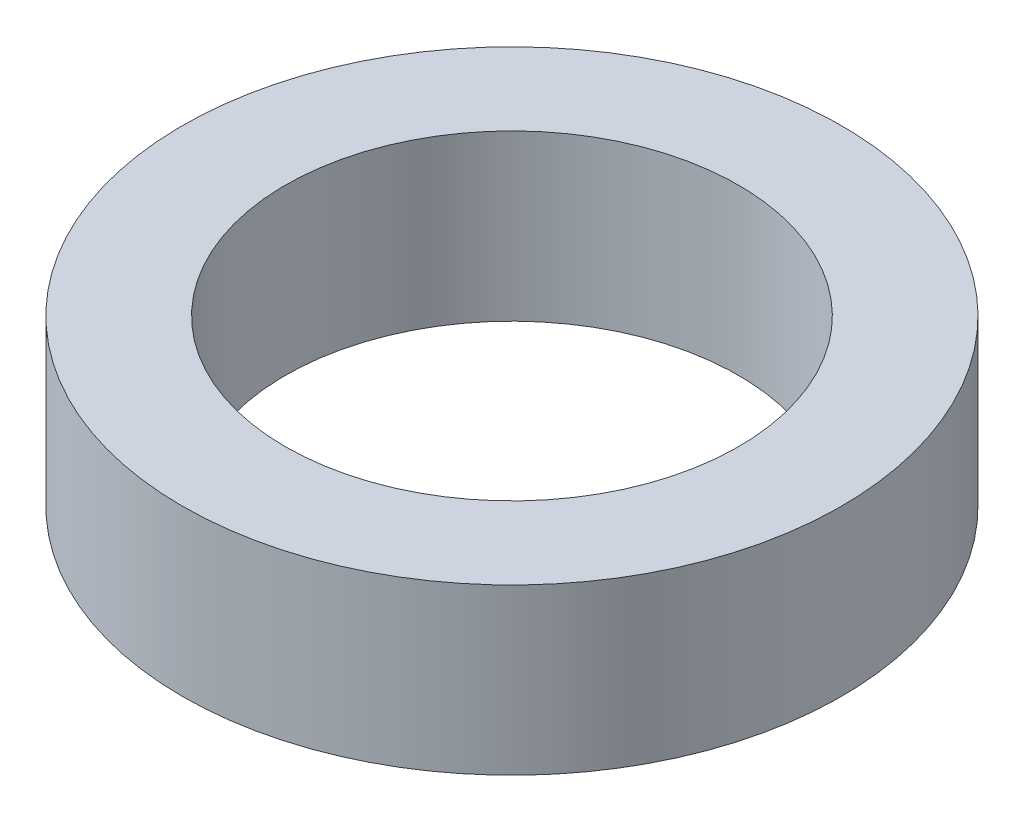
ISO-10303-21;
HEADER;
FILE_DESCRIPTION(('STEP AP214'),'2;1');
FILE_NAME('part.step','',(''),(''),'','','');
FILE_SCHEMA(('AUTOMOTIVE_DESIGN { 1 0 10303 214 1 1 1 1 }'));
ENDSEC;
DATA;
#1=APPLICATION_CONTEXT('core data for automotive mechanical design processes');
#2=APPLICATION_PROTOCOL_DEFINITION('international standard','automotive_design',2000,#1);
#3=PRODUCT_CONTEXT('',#1,'mechanical');
#4=PRODUCT('Part','Part','',(#3));
#5=PRODUCT_RELATED_PRODUCT_CATEGORY('part','',(#4));
#6=PRODUCT_DEFINITION_FORMATION('','',#4);
#7=PRODUCT_DEFINITION_CONTEXT('part definition',#1,'design');
#8=PRODUCT_DEFINITION('design','',#6,#7);
#9=PRODUCT_DEFINITION_SHAPE('','',#8);
#10=(LENGTH_UNIT() NAMED_UNIT(*) SI_UNIT(.MILLI.,.METRE.));
#11=(NAMED_UNIT(*) PLANE_ANGLE_UNIT() SI_UNIT($,.RADIAN.));
#12=(NAMED_UNIT(*) SI_UNIT($,.STERADIAN.) SOLID_ANGLE_UNIT());
#13=UNCERTAINTY_MEASURE_WITH_UNIT(LENGTH_MEASURE(1.E-05),#10,'distance_accuracy_value','');
#14=(GEOMETRIC_REPRESENTATION_CONTEXT(3) GLOBAL_UNCERTAINTY_ASSIGNED_CONTEXT((#13)) GLOBAL_UNIT_ASSIGNED_CONTEXT((#10,
#11,#12)) REPRESENTATION_CONTEXT('',''));
#15=CARTESIAN_POINT('',(0.,0.,0.));
#16=DIRECTION('',(0.,0.,1.));
#17=DIRECTION('',(1.,0.,0.));
#18=AXIS2_PLACEMENT_3D('',#15,#16,#17);
#19=CARTESIAN_POINT('',(0.,1.5875,0.));
#20=DIRECTION('',(0.,1.,0.));
#21=DIRECTION('',(0.,0.,1.));
#22=AXIS2_PLACEMENT_3D('',#19,#20,#21);
#23=PLANE('',#22);
#24=CARTESIAN_POINT('',(0.,1.5875,0.));
#25=DIRECTION('',(0.,1.,0.));
#26=DIRECTION('',(0.,0.,1.));
#27=AXIS2_PLACEMENT_3D('',#24,#25,#26);
#28=CIRCLE('',#27,3.175);
#29=CARTESIAN_POINT('',(0.,1.5875,3.175));
#30=VERTEX_POINT('',#29);
#31=EDGE_CURVE('E10',#30,#30,#28,.T.);
#32=ORIENTED_EDGE('',*,*,#31,.T.);
#33=EDGE_LOOP('',(#32));
#34=FACE_BOUND('',#33,.T.);
#35=CARTESIAN_POINT('',(0.,1.5875,0.));
#36=DIRECTION('',(0.,1.,0.));
#37=DIRECTION('',(0.,0.,1.));
#38=AXIS2_PLACEMENT_3D('',#35,#36,#37);
#39=CIRCLE('',#38,2.1828125);
#40=CARTESIAN_POINT('',(0.,1.5875,2.1828125));
#41=VERTEX_POINT('',#40);
#42=EDGE_CURVE('E52',#41,#41,#39,.T.);
#43=ORIENTED_EDGE('',*,*,#42,.F.);
#44=EDGE_LOOP('',(#43));
#45=FACE_BOUND('',#44,.T.);
#46=ADVANCED_FACE('F39',(#34,#45),#23,.T.);
#47=CARTESIAN_POINT('',(0.,0.,0.));
#48=DIRECTION('',(0.,1.,0.));
#49=DIRECTION('',(0.,0.,1.));
#50=AXIS2_PLACEMENT_3D('',#47,#48,#49);
#51=PLANE('',#50);
#52=CARTESIAN_POINT('',(0.,0.,0.));
#53=DIRECTION('',(0.,1.,0.));
#54=DIRECTION('',(0.,0.,1.));
#55=AXIS2_PLACEMENT_3D('',#52,#53,#54);
#56=CIRCLE('',#55,3.175);
#57=CARTESIAN_POINT('',(0.,0.,3.175));
#58=VERTEX_POINT('',#57);
#59=EDGE_CURVE('E43',#58,#58,#56,.T.);
#60=ORIENTED_EDGE('',*,*,#59,.F.);
#61=EDGE_LOOP('',(#60));
#62=FACE_BOUND('',#61,.T.);
#63=CARTESIAN_POINT('',(0.,0.,0.));
#64=DIRECTION('',(0.,1.,0.));
#65=DIRECTION('',(0.,0.,1.));
#66=AXIS2_PLACEMENT_3D('',#63,#64,#65);
#67=CIRCLE('',#66,2.1828125);
#68=CARTESIAN_POINT('',(0.,0.,2.1828125));
#69=VERTEX_POINT('',#68);
#70=EDGE_CURVE('E54',#69,#69,#67,.T.);
#71=ORIENTED_EDGE('',*,*,#70,.T.);
#72=EDGE_LOOP('',(#71));
#73=FACE_BOUND('',#72,.T.);
#74=ADVANCED_FACE('F66',(#62,#73),#51,.F.);
#75=CARTESIAN_POINT('',(0.,1.5875,0.));
#76=DIRECTION('',(0.,-1.,0.));
#77=DIRECTION('',(0.,0.,-1.));
#78=AXIS2_PLACEMENT_3D('',#75,#76,#77);
#79=CYLINDRICAL_SURFACE('',#78,3.175);
#80=ORIENTED_EDGE('',*,*,#31,.F.);
#81=EDGE_LOOP('',(#80));
#82=FACE_BOUND('',#81,.T.);
#83=ORIENTED_EDGE('',*,*,#59,.T.);
#84=EDGE_LOOP('',(#83));
#85=FACE_BOUND('',#84,.T.);
#86=ADVANCED_FACE('F41',(#82,#85),#79,.T.);
#87=CARTESIAN_POINT('',(0.,1.5875,0.));
#88=DIRECTION('',(0.,-1.,0.));
#89=DIRECTION('',(0.,0.,-1.));
#90=AXIS2_PLACEMENT_3D('',#87,#88,#89);
#91=CYLINDRICAL_SURFACE('',#90,2.1828125);
#92=ORIENTED_EDGE('',*,*,#42,.T.);
#93=EDGE_LOOP('',(#92));
#94=FACE_BOUND('',#93,.T.);
#95=ORIENTED_EDGE('',*,*,#70,.F.);
#96=EDGE_LOOP('',(#95));
#97=FACE_BOUND('',#96,.T.);
#98=ADVANCED_FACE('F62',(#94,#97),#91,.F.);
#99=CLOSED_SHELL('',(#46,#74,#86,#98));
#100=MANIFOLD_SOLID_BREP('B2',#99);
#101=ADVANCED_BREP_SHAPE_REPRESENTATION('',(#18,#100),#14);
#102=SHAPE_DEFINITION_REPRESENTATION(#9,#101);
ENDSEC;
END-ISO-10303-21;
